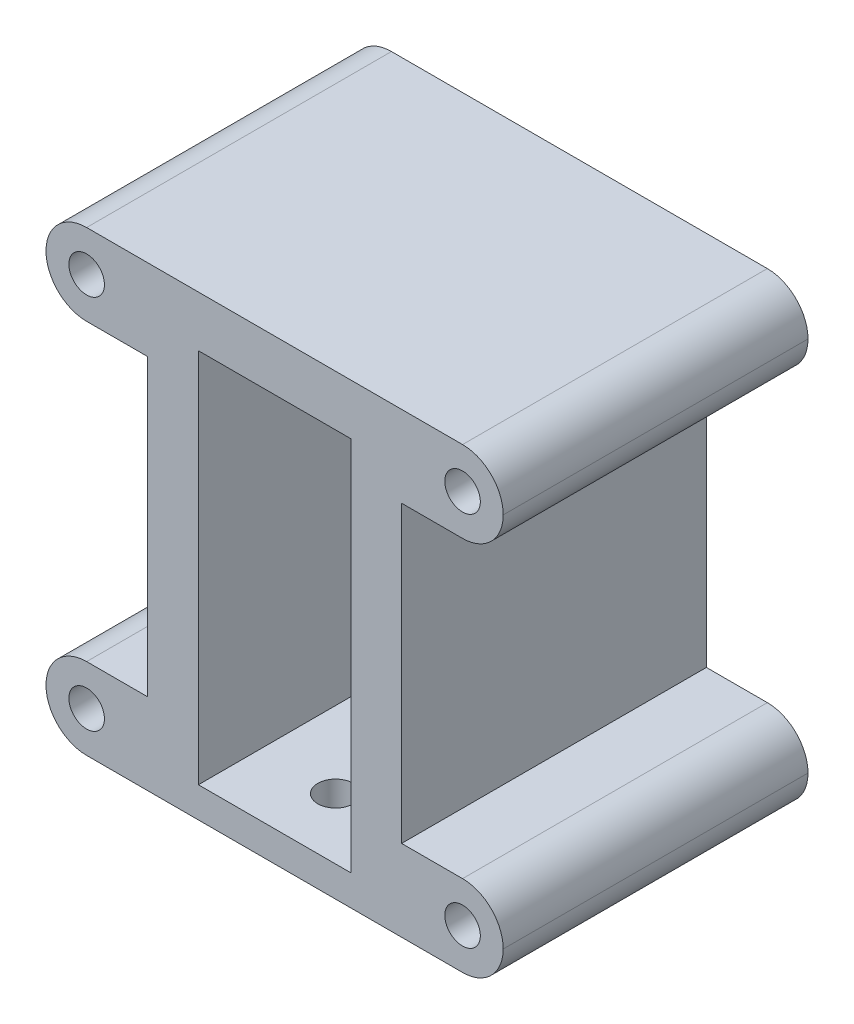
ISO-10303-21;
HEADER;
FILE_DESCRIPTION(('STEP AP214'),'2;1');
FILE_NAME('part.step','',(''),(''),'','','');
FILE_SCHEMA(('AUTOMOTIVE_DESIGN { 1 0 10303 214 1 1 1 1 }'));
ENDSEC;
DATA;
#1=APPLICATION_CONTEXT('core data for automotive mechanical design processes');
#2=APPLICATION_PROTOCOL_DEFINITION('international standard','automotive_design',2000,#1);
#3=PRODUCT_CONTEXT('',#1,'mechanical');
#4=PRODUCT('Part','Part','',(#3));
#5=PRODUCT_RELATED_PRODUCT_CATEGORY('part','',(#4));
#6=PRODUCT_DEFINITION_FORMATION('','',#4);
#7=PRODUCT_DEFINITION_CONTEXT('part definition',#1,'design');
#8=PRODUCT_DEFINITION('design','',#6,#7);
#9=PRODUCT_DEFINITION_SHAPE('','',#8);
#10=(LENGTH_UNIT() NAMED_UNIT(*) SI_UNIT(.MILLI.,.METRE.));
#11=(NAMED_UNIT(*) PLANE_ANGLE_UNIT() SI_UNIT($,.RADIAN.));
#12=(NAMED_UNIT(*) SI_UNIT($,.STERADIAN.) SOLID_ANGLE_UNIT());
#13=UNCERTAINTY_MEASURE_WITH_UNIT(LENGTH_MEASURE(1.E-05),#10,'distance_accuracy_value','');
#14=(GEOMETRIC_REPRESENTATION_CONTEXT(3) GLOBAL_UNCERTAINTY_ASSIGNED_CONTEXT((#13)) GLOBAL_UNIT_ASSIGNED_CONTEXT((#10,
#11,#12)) REPRESENTATION_CONTEXT('',''));
#15=CARTESIAN_POINT('',(0.,0.,0.));
#16=DIRECTION('',(0.,0.,1.));
#17=DIRECTION('',(1.,0.,0.));
#18=AXIS2_PLACEMENT_3D('',#15,#16,#17);
#19=CARTESIAN_POINT('',(-17.0156546986573,-27.,30.));
#20=DIRECTION('',(1.,0.,0.));
#21=DIRECTION('',(0.,1.,0.));
#22=AXIS2_PLACEMENT_3D('',#19,#20,#21);
#23=PLANE('',#22);
#24=DIRECTION('',(0.,0.,-1.));
#25=VECTOR('',#24,1.);
#26=CARTESIAN_POINT('',(-17.0156546986573,-19.,0.));
#27=LINE('',#26,#25);
#28=CARTESIAN_POINT('',(-17.0156546986573,-19.,30.));
#29=VERTEX_POINT('',#28);
#30=CARTESIAN_POINT('',(-17.0156546986573,-19.,0.));
#31=VERTEX_POINT('',#30);
#32=EDGE_CURVE('E226',#29,#31,#27,.T.);
#33=ORIENTED_EDGE('',*,*,#32,.F.);
#34=DIRECTION('',(0.,-1.,0.));
#35=VECTOR('',#34,1.);
#36=CARTESIAN_POINT('',(-17.0156546986573,-27.,30.));
#37=LINE('',#36,#35);
#38=CARTESIAN_POINT('',(-17.0156546986573,10.,30.));
#39=VERTEX_POINT('',#38);
#40=EDGE_CURVE('E271',#39,#29,#37,.T.);
#41=ORIENTED_EDGE('',*,*,#40,.F.);
#42=DIRECTION('',(0.,0.,1.));
#43=VECTOR('',#42,1.);
#44=CARTESIAN_POINT('',(-17.0156546986573,10.,0.));
#45=LINE('',#44,#43);
#46=CARTESIAN_POINT('',(-17.0156546986573,9.99999999999999,0.));
#47=VERTEX_POINT('',#46);
#48=EDGE_CURVE('E229',#47,#39,#45,.T.);
#49=ORIENTED_EDGE('',*,*,#48,.F.);
#50=DIRECTION('',(0.,-1.,0.));
#51=VECTOR('',#50,1.);
#52=CARTESIAN_POINT('',(-17.0156546986573,-27.,0.));
#53=LINE('',#52,#51);
#54=EDGE_CURVE('E279',#47,#31,#53,.T.);
#55=ORIENTED_EDGE('',*,*,#54,.T.);
#56=EDGE_LOOP('',(#33,#41,#49,#55));
#57=FACE_BOUND('',#56,.T.);
#58=ADVANCED_FACE('F36',(#57),#23,.F.);
#59=CARTESIAN_POINT('',(0.,0.,30.));
#60=DIRECTION('',(0.,0.,-1.));
#61=DIRECTION('',(-1.,0.,0.));
#62=AXIS2_PLACEMENT_3D('',#59,#60,#61);
#63=PLANE('',#62);
#64=CARTESIAN_POINT('',(13.9843453013427,14.,30.));
#65=DIRECTION('',(0.,0.,-1.));
#66=DIRECTION('',(-1.,0.,0.));
#67=AXIS2_PLACEMENT_3D('',#64,#65,#66);
#68=CIRCLE('',#67,1.75);
#69=CARTESIAN_POINT('',(12.2343453013427,14.,30.));
#70=VERTEX_POINT('',#69);
#71=EDGE_CURVE('E370',#70,#70,#68,.F.);
#72=ORIENTED_EDGE('',*,*,#71,.F.);
#73=EDGE_LOOP('',(#72));
#74=FACE_BOUND('',#73,.T.);
#75=CARTESIAN_POINT('',(13.9843453013427,-23.,30.));
#76=DIRECTION('',(0.,0.,-1.));
#77=DIRECTION('',(-1.,0.,0.));
#78=AXIS2_PLACEMENT_3D('',#75,#76,#77);
#79=CIRCLE('',#78,1.75);
#80=CARTESIAN_POINT('',(12.2343453013427,-23.,30.));
#81=VERTEX_POINT('',#80);
#82=EDGE_CURVE('E366',#81,#81,#79,.F.);
#83=ORIENTED_EDGE('',*,*,#82,.F.);
#84=EDGE_LOOP('',(#83));
#85=FACE_BOUND('',#84,.T.);
#86=CARTESIAN_POINT('',(-23.0156546986573,14.,30.));
#87=DIRECTION('',(0.,0.,-1.));
#88=DIRECTION('',(-1.,0.,0.));
#89=AXIS2_PLACEMENT_3D('',#86,#87,#88);
#90=CIRCLE('',#89,1.75);
#91=CARTESIAN_POINT('',(-24.7656546986573,14.,30.));
#92=VERTEX_POINT('',#91);
#93=EDGE_CURVE('E219',#92,#92,#90,.T.);
#94=ORIENTED_EDGE('',*,*,#93,.T.);
#95=EDGE_LOOP('',(#94));
#96=FACE_BOUND('',#95,.T.);
#97=CARTESIAN_POINT('',(-23.0156546986573,-23.,30.));
#98=DIRECTION('',(0.,0.,-1.));
#99=DIRECTION('',(-1.,0.,0.));
#100=AXIS2_PLACEMENT_3D('',#97,#98,#99);
#101=CIRCLE('',#100,1.75);
#102=CARTESIAN_POINT('',(-24.7656546986573,-23.,30.));
#103=VERTEX_POINT('',#102);
#104=EDGE_CURVE('E212',#103,#103,#101,.T.);
#105=ORIENTED_EDGE('',*,*,#104,.T.);
#106=EDGE_LOOP('',(#105));
#107=FACE_BOUND('',#106,.T.);
#108=DIRECTION('',(1.,0.,0.));
#109=VECTOR('',#108,1.);
#110=CARTESIAN_POINT('',(-17.0156546986573,-27.,30.));
#111=LINE('',#110,#109);
#112=CARTESIAN_POINT('',(-23.0156546986573,-27.,30.));
#113=VERTEX_POINT('',#112);
#114=CARTESIAN_POINT('',(13.9843453013427,-27.,30.));
#115=VERTEX_POINT('',#114);
#116=EDGE_CURVE('E274',#113,#115,#111,.T.);
#117=ORIENTED_EDGE('',*,*,#116,.T.);
#118=CARTESIAN_POINT('',(13.9843453013427,-23.,30.));
#119=DIRECTION('',(0.,0.,-1.));
#120=DIRECTION('',(-1.,0.,0.));
#121=AXIS2_PLACEMENT_3D('',#118,#119,#120);
#122=CIRCLE('',#121,4.);
#123=CARTESIAN_POINT('',(17.9843453013427,-23.,30.));
#124=VERTEX_POINT('',#123);
#125=EDGE_CURVE('E324',#115,#124,#122,.F.);
#126=ORIENTED_EDGE('',*,*,#125,.T.);
#127=CARTESIAN_POINT('',(13.9843453013427,-23.,30.));
#128=DIRECTION('',(0.,0.,-1.));
#129=DIRECTION('',(-1.,0.,0.));
#130=AXIS2_PLACEMENT_3D('',#127,#128,#129);
#131=CIRCLE('',#130,4.);
#132=CARTESIAN_POINT('',(13.9843453013427,-19.,30.));
#133=VERTEX_POINT('',#132);
#134=EDGE_CURVE('E322',#124,#133,#131,.F.);
#135=ORIENTED_EDGE('',*,*,#134,.T.);
#136=DIRECTION('',(-1.,0.,0.));
#137=VECTOR('',#136,1.);
#138=CARTESIAN_POINT('',(17.9843453013427,-19.,30.));
#139=LINE('',#138,#137);
#140=CARTESIAN_POINT('',(7.98434530134273,-19.,30.));
#141=VERTEX_POINT('',#140);
#142=EDGE_CURVE('E203',#133,#141,#139,.T.);
#143=ORIENTED_EDGE('',*,*,#142,.T.);
#144=DIRECTION('',(0.,1.,0.));
#145=VECTOR('',#144,1.);
#146=CARTESIAN_POINT('',(7.98434530134273,-27.,30.));
#147=LINE('',#146,#145);
#148=CARTESIAN_POINT('',(7.98434530134273,9.99999999999999,30.));
#149=VERTEX_POINT('',#148);
#150=EDGE_CURVE('E266',#141,#149,#147,.T.);
#151=ORIENTED_EDGE('',*,*,#150,.T.);
#152=DIRECTION('',(-1.,0.,0.));
#153=VECTOR('',#152,1.);
#154=CARTESIAN_POINT('',(17.9843453013427,10.,30.));
#155=LINE('',#154,#153);
#156=CARTESIAN_POINT('',(13.9843453013427,10.,30.));
#157=VERTEX_POINT('',#156);
#158=EDGE_CURVE('E185',#157,#149,#155,.T.);
#159=ORIENTED_EDGE('',*,*,#158,.F.);
#160=CARTESIAN_POINT('',(13.9843453013427,14.,30.));
#161=DIRECTION('',(0.,0.,-1.));
#162=DIRECTION('',(-1.,0.,0.));
#163=AXIS2_PLACEMENT_3D('',#160,#161,#162);
#164=CIRCLE('',#163,4.);
#165=CARTESIAN_POINT('',(17.9843453013427,14.,30.));
#166=VERTEX_POINT('',#165);
#167=EDGE_CURVE('E320',#157,#166,#164,.F.);
#168=ORIENTED_EDGE('',*,*,#167,.T.);
#169=CARTESIAN_POINT('',(13.9843453013427,14.,30.));
#170=DIRECTION('',(0.,0.,-1.));
#171=DIRECTION('',(-1.,0.,0.));
#172=AXIS2_PLACEMENT_3D('',#169,#170,#171);
#173=CIRCLE('',#172,4.);
#174=CARTESIAN_POINT('',(13.9843453013427,18.,30.));
#175=VERTEX_POINT('',#174);
#176=EDGE_CURVE('E318',#166,#175,#173,.F.);
#177=ORIENTED_EDGE('',*,*,#176,.T.);
#178=DIRECTION('',(-1.,0.,0.));
#179=VECTOR('',#178,1.);
#180=CARTESIAN_POINT('',(-17.0156546986573,18.,30.));
#181=LINE('',#180,#179);
#182=CARTESIAN_POINT('',(-23.0156546986573,18.,30.));
#183=VERTEX_POINT('',#182);
#184=EDGE_CURVE('E268',#175,#183,#181,.T.);
#185=ORIENTED_EDGE('',*,*,#184,.T.);
#186=CARTESIAN_POINT('',(-23.0156546986573,14.,30.));
#187=DIRECTION('',(0.,0.,-1.));
#188=DIRECTION('',(-1.,0.,0.));
#189=AXIS2_PLACEMENT_3D('',#186,#187,#188);
#190=CIRCLE('',#189,4.);
#191=CARTESIAN_POINT('',(-27.0156546986573,14.,30.));
#192=VERTEX_POINT('',#191);
#193=EDGE_CURVE('E276',#183,#192,#190,.F.);
#194=ORIENTED_EDGE('',*,*,#193,.T.);
#195=CARTESIAN_POINT('',(-23.0156546986573,14.,30.));
#196=DIRECTION('',(0.,0.,-1.));
#197=DIRECTION('',(-1.,0.,0.));
#198=AXIS2_PLACEMENT_3D('',#195,#196,#197);
#199=CIRCLE('',#198,4.);
#200=CARTESIAN_POINT('',(-23.0156546986573,10.,30.));
#201=VERTEX_POINT('',#200);
#202=EDGE_CURVE('E285',#192,#201,#199,.F.);
#203=ORIENTED_EDGE('',*,*,#202,.T.);
#204=DIRECTION('',(1.,0.,0.));
#205=VECTOR('',#204,1.);
#206=CARTESIAN_POINT('',(-27.0156546986573,10.,30.));
#207=LINE('',#206,#205);
#208=EDGE_CURVE('E232',#201,#39,#207,.T.);
#209=ORIENTED_EDGE('',*,*,#208,.T.);
#210=ORIENTED_EDGE('',*,*,#40,.T.);
#211=DIRECTION('',(1.,0.,0.));
#212=VECTOR('',#211,1.);
#213=CARTESIAN_POINT('',(-27.0156546986573,-19.,30.));
#214=LINE('',#213,#212);
#215=CARTESIAN_POINT('',(-23.0156546986573,-19.,30.));
#216=VERTEX_POINT('',#215);
#217=EDGE_CURVE('E222',#216,#29,#214,.T.);
#218=ORIENTED_EDGE('',*,*,#217,.F.);
#219=CARTESIAN_POINT('',(-23.0156546986573,-23.,30.));
#220=DIRECTION('',(0.,0.,-1.));
#221=DIRECTION('',(-1.,0.,0.));
#222=AXIS2_PLACEMENT_3D('',#219,#220,#221);
#223=CIRCLE('',#222,4.);
#224=CARTESIAN_POINT('',(-27.0156546986573,-23.,30.));
#225=VERTEX_POINT('',#224);
#226=EDGE_CURVE('E287',#216,#225,#223,.F.);
#227=ORIENTED_EDGE('',*,*,#226,.T.);
#228=CARTESIAN_POINT('',(-23.0156546986573,-23.,30.));
#229=DIRECTION('',(0.,0.,-1.));
#230=DIRECTION('',(-1.,0.,0.));
#231=AXIS2_PLACEMENT_3D('',#228,#229,#230);
#232=CIRCLE('',#231,4.);
#233=EDGE_CURVE('E289',#225,#113,#232,.F.);
#234=ORIENTED_EDGE('',*,*,#233,.T.);
#235=EDGE_LOOP('',(#117,#126,#135,#143,#151,#159,#168,#177,#185,#194,#203,#209,#210,#218,#227,#234));
#236=FACE_BOUND('',#235,.T.);
#237=DIRECTION('',(0.,1.,0.));
#238=VECTOR('',#237,1.);
#239=CARTESIAN_POINT('',(2.98434530134273,-24.,30.));
#240=LINE('',#239,#238);
#241=CARTESIAN_POINT('',(2.98434530134273,-24.,30.));
#242=VERTEX_POINT('',#241);
#243=CARTESIAN_POINT('',(2.98434530134273,13.,30.));
#244=VERTEX_POINT('',#243);
#245=EDGE_CURVE('E237',#242,#244,#240,.T.);
#246=ORIENTED_EDGE('',*,*,#245,.F.);
#247=DIRECTION('',(1.,0.,0.));
#248=VECTOR('',#247,1.);
#249=CARTESIAN_POINT('',(-12.0156546986573,-24.,30.));
#250=LINE('',#249,#248);
#251=CARTESIAN_POINT('',(-12.0156546986573,-24.,30.));
#252=VERTEX_POINT('',#251);
#253=EDGE_CURVE('E245',#252,#242,#250,.T.);
#254=ORIENTED_EDGE('',*,*,#253,.F.);
#255=DIRECTION('',(0.,-1.,0.));
#256=VECTOR('',#255,1.);
#257=CARTESIAN_POINT('',(-12.0156546986573,-24.,30.));
#258=LINE('',#257,#256);
#259=CARTESIAN_POINT('',(-12.0156546986573,13.,30.));
#260=VERTEX_POINT('',#259);
#261=EDGE_CURVE('E242',#260,#252,#258,.T.);
#262=ORIENTED_EDGE('',*,*,#261,.F.);
#263=DIRECTION('',(-1.,0.,0.));
#264=VECTOR('',#263,1.);
#265=CARTESIAN_POINT('',(-12.0156546986573,13.,30.));
#266=LINE('',#265,#264);
#267=EDGE_CURVE('E239',#244,#260,#266,.T.);
#268=ORIENTED_EDGE('',*,*,#267,.F.);
#269=EDGE_LOOP('',(#246,#254,#262,#268));
#270=FACE_BOUND('',#269,.T.);
#271=ADVANCED_FACE('F374',(#74,#85,#96,#107,#236,#270),#63,.F.);
#272=CARTESIAN_POINT('',(0.,0.,0.));
#273=DIRECTION('',(0.,0.,-1.));
#274=DIRECTION('',(-1.,0.,0.));
#275=AXIS2_PLACEMENT_3D('',#272,#273,#274);
#276=PLANE('',#275);
#277=CARTESIAN_POINT('',(13.9843453013427,14.,0.));
#278=DIRECTION('',(0.,0.,-1.));
#279=DIRECTION('',(-1.,0.,0.));
#280=AXIS2_PLACEMENT_3D('',#277,#278,#279);
#281=CIRCLE('',#280,1.75);
#282=CARTESIAN_POINT('',(12.2343453013427,14.,0.));
#283=VERTEX_POINT('',#282);
#284=EDGE_CURVE('E339',#283,#283,#281,.T.);
#285=ORIENTED_EDGE('',*,*,#284,.F.);
#286=EDGE_LOOP('',(#285));
#287=FACE_BOUND('',#286,.T.);
#288=CARTESIAN_POINT('',(13.9843453013427,-23.,0.));
#289=DIRECTION('',(0.,0.,-1.));
#290=DIRECTION('',(-1.,0.,0.));
#291=AXIS2_PLACEMENT_3D('',#288,#289,#290);
#292=CIRCLE('',#291,1.75);
#293=CARTESIAN_POINT('',(12.2343453013427,-23.,0.));
#294=VERTEX_POINT('',#293);
#295=EDGE_CURVE('E335',#294,#294,#292,.T.);
#296=ORIENTED_EDGE('',*,*,#295,.F.);
#297=EDGE_LOOP('',(#296));
#298=FACE_BOUND('',#297,.T.);
#299=CARTESIAN_POINT('',(-23.0156546986573,14.,0.));
#300=DIRECTION('',(0.,0.,1.));
#301=DIRECTION('',(1.,0.,0.));
#302=AXIS2_PLACEMENT_3D('',#299,#300,#301);
#303=CIRCLE('',#302,1.75);
#304=CARTESIAN_POINT('',(-21.2656546986573,14.,0.));
#305=VERTEX_POINT('',#304);
#306=EDGE_CURVE('E209',#305,#305,#303,.T.);
#307=ORIENTED_EDGE('',*,*,#306,.T.);
#308=EDGE_LOOP('',(#307));
#309=FACE_BOUND('',#308,.T.);
#310=CARTESIAN_POINT('',(-23.0156546986573,-23.,0.));
#311=DIRECTION('',(0.,0.,1.));
#312=DIRECTION('',(1.,0.,0.));
#313=AXIS2_PLACEMENT_3D('',#310,#311,#312);
#314=CIRCLE('',#313,1.75);
#315=CARTESIAN_POINT('',(-21.2656546986573,-23.,0.));
#316=VERTEX_POINT('',#315);
#317=EDGE_CURVE('E213',#316,#316,#314,.T.);
#318=ORIENTED_EDGE('',*,*,#317,.T.);
#319=EDGE_LOOP('',(#318));
#320=FACE_BOUND('',#319,.T.);
#321=CARTESIAN_POINT('',(13.9843453013427,-23.,0.));
#322=DIRECTION('',(0.,0.,-1.));
#323=DIRECTION('',(-1.,0.,0.));
#324=AXIS2_PLACEMENT_3D('',#321,#322,#323);
#325=CIRCLE('',#324,4.);
#326=CARTESIAN_POINT('',(13.9843453013427,-19.,0.));
#327=VERTEX_POINT('',#326);
#328=CARTESIAN_POINT('',(17.9843453013427,-23.,0.));
#329=VERTEX_POINT('',#328);
#330=EDGE_CURVE('E53',#327,#329,#325,.T.);
#331=ORIENTED_EDGE('',*,*,#330,.T.);
#332=CARTESIAN_POINT('',(13.9843453013427,-23.,0.));
#333=DIRECTION('',(0.,0.,-1.));
#334=DIRECTION('',(-1.,0.,0.));
#335=AXIS2_PLACEMENT_3D('',#332,#333,#334);
#336=CIRCLE('',#335,4.);
#337=CARTESIAN_POINT('',(13.9843453013427,-27.,0.));
#338=VERTEX_POINT('',#337);
#339=EDGE_CURVE('E330',#329,#338,#336,.T.);
#340=ORIENTED_EDGE('',*,*,#339,.T.);
#341=DIRECTION('',(1.,0.,0.));
#342=VECTOR('',#341,1.);
#343=CARTESIAN_POINT('',(-17.0156546986573,-27.,0.));
#344=LINE('',#343,#342);
#345=CARTESIAN_POINT('',(-23.0156546986573,-27.,0.));
#346=VERTEX_POINT('',#345);
#347=EDGE_CURVE('E269',#346,#338,#344,.T.);
#348=ORIENTED_EDGE('',*,*,#347,.F.);
#349=CARTESIAN_POINT('',(-23.0156546986573,-23.,0.));
#350=DIRECTION('',(0.,0.,-1.));
#351=DIRECTION('',(-1.,0.,0.));
#352=AXIS2_PLACEMENT_3D('',#349,#350,#351);
#353=CIRCLE('',#352,4.);
#354=CARTESIAN_POINT('',(-27.0156546986573,-23.,0.));
#355=VERTEX_POINT('',#354);
#356=EDGE_CURVE('E301',#346,#355,#353,.T.);
#357=ORIENTED_EDGE('',*,*,#356,.T.);
#358=CARTESIAN_POINT('',(-23.0156546986573,-23.,0.));
#359=DIRECTION('',(0.,0.,-1.));
#360=DIRECTION('',(-1.,0.,0.));
#361=AXIS2_PLACEMENT_3D('',#358,#359,#360);
#362=CIRCLE('',#361,4.);
#363=CARTESIAN_POINT('',(-23.0156546986573,-19.,0.));
#364=VERTEX_POINT('',#363);
#365=EDGE_CURVE('E299',#355,#364,#362,.T.);
#366=ORIENTED_EDGE('',*,*,#365,.T.);
#367=DIRECTION('',(1.,0.,0.));
#368=VECTOR('',#367,1.);
#369=CARTESIAN_POINT('',(-27.0156546986573,-19.,0.));
#370=LINE('',#369,#368);
#371=EDGE_CURVE('E224',#364,#31,#370,.T.);
#372=ORIENTED_EDGE('',*,*,#371,.T.);
#373=ORIENTED_EDGE('',*,*,#54,.F.);
#374=DIRECTION('',(1.,0.,0.));
#375=VECTOR('',#374,1.);
#376=CARTESIAN_POINT('',(-27.0156546986573,10.,0.));
#377=LINE('',#376,#375);
#378=CARTESIAN_POINT('',(-23.0156546986573,10.,0.));
#379=VERTEX_POINT('',#378);
#380=EDGE_CURVE('E234',#379,#47,#377,.T.);
#381=ORIENTED_EDGE('',*,*,#380,.F.);
#382=CARTESIAN_POINT('',(-23.0156546986573,14.,0.));
#383=DIRECTION('',(0.,0.,-1.));
#384=DIRECTION('',(-1.,0.,0.));
#385=AXIS2_PLACEMENT_3D('',#382,#383,#384);
#386=CIRCLE('',#385,4.);
#387=CARTESIAN_POINT('',(-27.0156546986573,14.,0.));
#388=VERTEX_POINT('',#387);
#389=EDGE_CURVE('E297',#379,#388,#386,.T.);
#390=ORIENTED_EDGE('',*,*,#389,.T.);
#391=CARTESIAN_POINT('',(-23.0156546986573,14.,0.));
#392=DIRECTION('',(0.,0.,-1.));
#393=DIRECTION('',(-1.,0.,0.));
#394=AXIS2_PLACEMENT_3D('',#391,#392,#393);
#395=CIRCLE('',#394,4.);
#396=CARTESIAN_POINT('',(-23.0156546986573,18.,0.));
#397=VERTEX_POINT('',#396);
#398=EDGE_CURVE('E294',#388,#397,#395,.T.);
#399=ORIENTED_EDGE('',*,*,#398,.T.);
#400=DIRECTION('',(-1.,0.,0.));
#401=VECTOR('',#400,1.);
#402=CARTESIAN_POINT('',(-17.0156546986573,18.,0.));
#403=LINE('',#402,#401);
#404=CARTESIAN_POINT('',(13.9843453013427,18.,0.));
#405=VERTEX_POINT('',#404);
#406=EDGE_CURVE('E195',#405,#397,#403,.T.);
#407=ORIENTED_EDGE('',*,*,#406,.F.);
#408=CARTESIAN_POINT('',(13.9843453013427,14.,0.));
#409=DIRECTION('',(0.,0.,-1.));
#410=DIRECTION('',(-1.,0.,0.));
#411=AXIS2_PLACEMENT_3D('',#408,#409,#410);
#412=CIRCLE('',#411,4.);
#413=CARTESIAN_POINT('',(17.9843453013427,14.,0.));
#414=VERTEX_POINT('',#413);
#415=EDGE_CURVE('E326',#405,#414,#412,.T.);
#416=ORIENTED_EDGE('',*,*,#415,.T.);
#417=CARTESIAN_POINT('',(13.9843453013427,14.,0.));
#418=DIRECTION('',(0.,0.,-1.));
#419=DIRECTION('',(-1.,0.,0.));
#420=AXIS2_PLACEMENT_3D('',#417,#418,#419);
#421=CIRCLE('',#420,4.);
#422=CARTESIAN_POINT('',(13.9843453013427,10.,0.));
#423=VERTEX_POINT('',#422);
#424=EDGE_CURVE('E180',#414,#423,#421,.T.);
#425=ORIENTED_EDGE('',*,*,#424,.T.);
#426=DIRECTION('',(-1.,0.,0.));
#427=VECTOR('',#426,1.);
#428=CARTESIAN_POINT('',(17.9843453013427,10.,0.));
#429=LINE('',#428,#427);
#430=CARTESIAN_POINT('',(7.98434530134273,10.,0.));
#431=VERTEX_POINT('',#430);
#432=EDGE_CURVE('E174',#423,#431,#429,.T.);
#433=ORIENTED_EDGE('',*,*,#432,.T.);
#434=DIRECTION('',(0.,1.,0.));
#435=VECTOR('',#434,1.);
#436=CARTESIAN_POINT('',(7.98434530134273,-27.,0.));
#437=LINE('',#436,#435);
#438=CARTESIAN_POINT('',(7.98434530134273,-19.,0.));
#439=VERTEX_POINT('',#438);
#440=EDGE_CURVE('E178',#439,#431,#437,.T.);
#441=ORIENTED_EDGE('',*,*,#440,.F.);
#442=DIRECTION('',(-1.,0.,0.));
#443=VECTOR('',#442,1.);
#444=CARTESIAN_POINT('',(17.9843453013427,-19.,0.));
#445=LINE('',#444,#443);
#446=EDGE_CURVE('E201',#327,#439,#445,.T.);
#447=ORIENTED_EDGE('',*,*,#446,.F.);
#448=EDGE_LOOP('',(#331,#340,#348,#357,#366,#372,#373,#381,#390,#399,#407,#416,#425,#433,#441,#447));
#449=FACE_BOUND('',#448,.T.);
#450=DIRECTION('',(1.,0.,0.));
#451=VECTOR('',#450,1.);
#452=CARTESIAN_POINT('',(-12.0156546986573,-24.,0.));
#453=LINE('',#452,#451);
#454=CARTESIAN_POINT('',(-12.0156546986573,-24.,0.));
#455=VERTEX_POINT('',#454);
#456=CARTESIAN_POINT('',(2.98434530134273,-24.,0.));
#457=VERTEX_POINT('',#456);
#458=EDGE_CURVE('E240',#455,#457,#453,.T.);
#459=ORIENTED_EDGE('',*,*,#458,.T.);
#460=DIRECTION('',(0.,1.,0.));
#461=VECTOR('',#460,1.);
#462=CARTESIAN_POINT('',(2.98434530134273,-24.,0.));
#463=LINE('',#462,#461);
#464=CARTESIAN_POINT('',(2.98434530134273,13.,0.));
#465=VERTEX_POINT('',#464);
#466=EDGE_CURVE('E236',#457,#465,#463,.T.);
#467=ORIENTED_EDGE('',*,*,#466,.T.);
#468=DIRECTION('',(-1.,0.,0.));
#469=VECTOR('',#468,1.);
#470=CARTESIAN_POINT('',(-12.0156546986573,13.,0.));
#471=LINE('',#470,#469);
#472=CARTESIAN_POINT('',(-12.0156546986573,13.,0.));
#473=VERTEX_POINT('',#472);
#474=EDGE_CURVE('E250',#465,#473,#471,.T.);
#475=ORIENTED_EDGE('',*,*,#474,.T.);
#476=DIRECTION('',(0.,-1.,0.));
#477=VECTOR('',#476,1.);
#478=CARTESIAN_POINT('',(-12.0156546986573,-24.,0.));
#479=LINE('',#478,#477);
#480=EDGE_CURVE('E253',#473,#455,#479,.T.);
#481=ORIENTED_EDGE('',*,*,#480,.T.);
#482=EDGE_LOOP('',(#459,#467,#475,#481));
#483=FACE_BOUND('',#482,.T.);
#484=ADVANCED_FACE('F176',(#287,#298,#309,#320,#449,#483),#276,.T.);
#485=CARTESIAN_POINT('',(7.98434530134273,-27.,30.));
#486=DIRECTION('',(-1.,0.,0.));
#487=DIRECTION('',(0.,0.,1.));
#488=AXIS2_PLACEMENT_3D('',#485,#486,#487);
#489=PLANE('',#488);
#490=ORIENTED_EDGE('',*,*,#150,.F.);
#491=DIRECTION('',(0.,0.,-1.));
#492=VECTOR('',#491,1.);
#493=CARTESIAN_POINT('',(7.98434530134273,-19.,0.));
#494=LINE('',#493,#492);
#495=EDGE_CURVE('E194',#141,#439,#494,.T.);
#496=ORIENTED_EDGE('',*,*,#495,.T.);
#497=ORIENTED_EDGE('',*,*,#440,.T.);
#498=DIRECTION('',(0.,0.,1.));
#499=VECTOR('',#498,1.);
#500=CARTESIAN_POINT('',(7.98434530134273,10.,0.));
#501=LINE('',#500,#499);
#502=EDGE_CURVE('E186',#431,#149,#501,.T.);
#503=ORIENTED_EDGE('',*,*,#502,.T.);
#504=EDGE_LOOP('',(#490,#496,#497,#503));
#505=FACE_BOUND('',#504,.T.);
#506=ADVANCED_FACE('F192',(#505),#489,.F.);
#507=CARTESIAN_POINT('',(-17.0156546986573,18.,30.));
#508=DIRECTION('',(0.,-1.,0.));
#509=DIRECTION('',(0.,0.,-1.));
#510=AXIS2_PLACEMENT_3D('',#507,#508,#509);
#511=PLANE('',#510);
#512=ORIENTED_EDGE('',*,*,#184,.F.);
#513=DIRECTION('',(0.,0.,-1.));
#514=VECTOR('',#513,1.);
#515=CARTESIAN_POINT('',(13.9843453013427,18.,30.));
#516=LINE('',#515,#514);
#517=EDGE_CURVE('E11',#175,#405,#516,.T.);
#518=ORIENTED_EDGE('',*,*,#517,.T.);
#519=ORIENTED_EDGE('',*,*,#406,.T.);
#520=DIRECTION('',(0.,0.,-1.));
#521=VECTOR('',#520,1.);
#522=CARTESIAN_POINT('',(-23.0156546986573,18.,30.));
#523=LINE('',#522,#521);
#524=EDGE_CURVE('E308',#397,#183,#523,.F.);
#525=ORIENTED_EDGE('',*,*,#524,.T.);
#526=EDGE_LOOP('',(#512,#518,#519,#525));
#527=FACE_BOUND('',#526,.T.);
#528=ADVANCED_FACE('F424',(#527),#511,.F.);
#529=CARTESIAN_POINT('',(-17.0156546986573,-27.,30.));
#530=DIRECTION('',(0.,1.,0.));
#531=DIRECTION('',(0.,0.,1.));
#532=AXIS2_PLACEMENT_3D('',#529,#530,#531);
#533=PLANE('',#532);
#534=CARTESIAN_POINT('',(-4.51565469865727,-27.,24.));
#535=DIRECTION('',(0.,1.,0.));
#536=DIRECTION('',(0.,0.,1.));
#537=AXIS2_PLACEMENT_3D('',#534,#535,#536);
#538=CIRCLE('',#537,1.75);
#539=CARTESIAN_POINT('',(-4.51565469865727,-27.,25.75));
#540=VERTEX_POINT('',#539);
#541=EDGE_CURVE('E342',#540,#540,#538,.T.);
#542=ORIENTED_EDGE('',*,*,#541,.T.);
#543=EDGE_LOOP('',(#542));
#544=FACE_BOUND('',#543,.T.);
#545=CARTESIAN_POINT('',(-4.51565469865727,-27.,6.00000000000001));
#546=DIRECTION('',(0.,1.,0.));
#547=DIRECTION('',(0.,0.,1.));
#548=AXIS2_PLACEMENT_3D('',#545,#546,#547);
#549=CIRCLE('',#548,1.75);
#550=CARTESIAN_POINT('',(-4.51565469865727,-27.,7.75000000000001));
#551=VERTEX_POINT('',#550);
#552=EDGE_CURVE('E356',#551,#551,#549,.T.);
#553=ORIENTED_EDGE('',*,*,#552,.T.);
#554=EDGE_LOOP('',(#553));
#555=FACE_BOUND('',#554,.T.);
#556=CARTESIAN_POINT('',(-4.51565469865727,-27.,15.));
#557=DIRECTION('',(0.,1.,0.));
#558=DIRECTION('',(0.,0.,1.));
#559=AXIS2_PLACEMENT_3D('',#556,#557,#558);
#560=CIRCLE('',#559,1.75);
#561=CARTESIAN_POINT('',(-4.51565469865727,-27.,16.75));
#562=VERTEX_POINT('',#561);
#563=EDGE_CURVE('E362',#562,#562,#560,.T.);
#564=ORIENTED_EDGE('',*,*,#563,.T.);
#565=EDGE_LOOP('',(#564));
#566=FACE_BOUND('',#565,.T.);
#567=ORIENTED_EDGE('',*,*,#347,.T.);
#568=DIRECTION('',(0.,0.,1.));
#569=VECTOR('',#568,1.);
#570=CARTESIAN_POINT('',(13.9843453013427,-27.,30.));
#571=LINE('',#570,#569);
#572=EDGE_CURVE('E311',#338,#115,#571,.T.);
#573=ORIENTED_EDGE('',*,*,#572,.T.);
#574=ORIENTED_EDGE('',*,*,#116,.F.);
#575=DIRECTION('',(0.,0.,1.));
#576=VECTOR('',#575,1.);
#577=CARTESIAN_POINT('',(-23.0156546986573,-27.,30.));
#578=LINE('',#577,#576);
#579=EDGE_CURVE('E291',#113,#346,#578,.F.);
#580=ORIENTED_EDGE('',*,*,#579,.T.);
#581=EDGE_LOOP('',(#567,#573,#574,#580));
#582=FACE_BOUND('',#581,.T.);
#583=ADVANCED_FACE('F384',(#544,#555,#566,#582),#533,.F.);
#584=CARTESIAN_POINT('',(2.98434530134273,-24.,30.));
#585=DIRECTION('',(-1.,0.,0.));
#586=DIRECTION('',(0.,0.,1.));
#587=AXIS2_PLACEMENT_3D('',#584,#585,#586);
#588=PLANE('',#587);
#589=ORIENTED_EDGE('',*,*,#466,.F.);
#590=DIRECTION('',(0.,0.,-1.));
#591=VECTOR('',#590,1.);
#592=CARTESIAN_POINT('',(2.98434530134273,-24.,30.));
#593=LINE('',#592,#591);
#594=EDGE_CURVE('E247',#242,#457,#593,.T.);
#595=ORIENTED_EDGE('',*,*,#594,.F.);
#596=ORIENTED_EDGE('',*,*,#245,.T.);
#597=DIRECTION('',(0.,0.,-1.));
#598=VECTOR('',#597,1.);
#599=CARTESIAN_POINT('',(2.98434530134273,13.,30.));
#600=LINE('',#599,#598);
#601=EDGE_CURVE('E196',#244,#465,#600,.T.);
#602=ORIENTED_EDGE('',*,*,#601,.T.);
#603=EDGE_LOOP('',(#589,#595,#596,#602));
#604=FACE_BOUND('',#603,.T.);
#605=ADVANCED_FACE('F504',(#604),#588,.T.);
#606=CARTESIAN_POINT('',(-12.0156546986573,13.,30.));
#607=DIRECTION('',(0.,-1.,0.));
#608=DIRECTION('',(0.,0.,-1.));
#609=AXIS2_PLACEMENT_3D('',#606,#607,#608);
#610=PLANE('',#609);
#611=ORIENTED_EDGE('',*,*,#474,.F.);
#612=ORIENTED_EDGE('',*,*,#601,.F.);
#613=ORIENTED_EDGE('',*,*,#267,.T.);
#614=DIRECTION('',(0.,0.,-1.));
#615=VECTOR('',#614,1.);
#616=CARTESIAN_POINT('',(-12.0156546986573,13.,30.));
#617=LINE('',#616,#615);
#618=EDGE_CURVE('E262',#260,#473,#617,.T.);
#619=ORIENTED_EDGE('',*,*,#618,.T.);
#620=EDGE_LOOP('',(#611,#612,#613,#619));
#621=FACE_BOUND('',#620,.T.);
#622=ADVANCED_FACE('F500',(#621),#610,.T.);
#623=CARTESIAN_POINT('',(-12.0156546986573,-24.,30.));
#624=DIRECTION('',(1.,0.,0.));
#625=DIRECTION('',(0.,0.,-1.));
#626=AXIS2_PLACEMENT_3D('',#623,#624,#625);
#627=PLANE('',#626);
#628=ORIENTED_EDGE('',*,*,#480,.F.);
#629=ORIENTED_EDGE('',*,*,#618,.F.);
#630=ORIENTED_EDGE('',*,*,#261,.T.);
#631=DIRECTION('',(0.,0.,-1.));
#632=VECTOR('',#631,1.);
#633=CARTESIAN_POINT('',(-12.0156546986573,-24.,30.));
#634=LINE('',#633,#632);
#635=EDGE_CURVE('E260',#252,#455,#634,.T.);
#636=ORIENTED_EDGE('',*,*,#635,.T.);
#637=EDGE_LOOP('',(#628,#629,#630,#636));
#638=FACE_BOUND('',#637,.T.);
#639=ADVANCED_FACE('F496',(#638),#627,.T.);
#640=CARTESIAN_POINT('',(-12.0156546986573,-24.,30.));
#641=DIRECTION('',(0.,1.,0.));
#642=DIRECTION('',(0.,0.,1.));
#643=AXIS2_PLACEMENT_3D('',#640,#641,#642);
#644=PLANE('',#643);
#645=CARTESIAN_POINT('',(-4.51565469865727,-24.,24.));
#646=DIRECTION('',(0.,1.,0.));
#647=DIRECTION('',(0.,0.,1.));
#648=AXIS2_PLACEMENT_3D('',#645,#646,#647);
#649=CIRCLE('',#648,1.75);
#650=CARTESIAN_POINT('',(-4.51565469865727,-24.,25.75));
#651=VERTEX_POINT('',#650);
#652=EDGE_CURVE('E346',#651,#651,#649,.T.);
#653=ORIENTED_EDGE('',*,*,#652,.F.);
#654=EDGE_LOOP('',(#653));
#655=FACE_BOUND('',#654,.T.);
#656=CARTESIAN_POINT('',(-4.51565469865727,-24.,6.00000000000001));
#657=DIRECTION('',(0.,1.,0.));
#658=DIRECTION('',(0.,0.,1.));
#659=AXIS2_PLACEMENT_3D('',#656,#657,#658);
#660=CIRCLE('',#659,1.75);
#661=CARTESIAN_POINT('',(-4.51565469865727,-24.,7.75000000000001));
#662=VERTEX_POINT('',#661);
#663=EDGE_CURVE('E351',#662,#662,#660,.T.);
#664=ORIENTED_EDGE('',*,*,#663,.F.);
#665=EDGE_LOOP('',(#664));
#666=FACE_BOUND('',#665,.T.);
#667=CARTESIAN_POINT('',(-4.51565469865727,-24.,15.));
#668=DIRECTION('',(0.,1.,0.));
#669=DIRECTION('',(0.,0.,1.));
#670=AXIS2_PLACEMENT_3D('',#667,#668,#669);
#671=CIRCLE('',#670,1.75);
#672=CARTESIAN_POINT('',(-4.51565469865727,-24.,16.75));
#673=VERTEX_POINT('',#672);
#674=EDGE_CURVE('E359',#673,#673,#671,.T.);
#675=ORIENTED_EDGE('',*,*,#674,.F.);
#676=EDGE_LOOP('',(#675));
#677=FACE_BOUND('',#676,.T.);
#678=ORIENTED_EDGE('',*,*,#458,.F.);
#679=ORIENTED_EDGE('',*,*,#635,.F.);
#680=ORIENTED_EDGE('',*,*,#253,.T.);
#681=ORIENTED_EDGE('',*,*,#594,.T.);
#682=EDGE_LOOP('',(#678,#679,#680,#681));
#683=FACE_BOUND('',#682,.T.);
#684=ADVANCED_FACE('F493',(#655,#666,#677,#683),#644,.T.);
#685=CARTESIAN_POINT('',(-27.0156546986573,10.,0.));
#686=DIRECTION('',(0.,1.,0.));
#687=DIRECTION('',(0.,0.,1.));
#688=AXIS2_PLACEMENT_3D('',#685,#686,#687);
#689=PLANE('',#688);
#690=ORIENTED_EDGE('',*,*,#208,.F.);
#691=DIRECTION('',(0.,0.,1.));
#692=VECTOR('',#691,1.);
#693=CARTESIAN_POINT('',(-23.0156546986573,10.,0.));
#694=LINE('',#693,#692);
#695=EDGE_CURVE('E305',#201,#379,#694,.F.);
#696=ORIENTED_EDGE('',*,*,#695,.T.);
#697=ORIENTED_EDGE('',*,*,#380,.T.);
#698=ORIENTED_EDGE('',*,*,#48,.T.);
#699=EDGE_LOOP('',(#690,#696,#697,#698));
#700=FACE_BOUND('',#699,.T.);
#701=ADVANCED_FACE('F407',(#700),#689,.F.);
#702=CARTESIAN_POINT('',(-27.0156546986573,-19.,0.));
#703=DIRECTION('',(0.,-1.,0.));
#704=DIRECTION('',(0.,0.,-1.));
#705=AXIS2_PLACEMENT_3D('',#702,#703,#704);
#706=PLANE('',#705);
#707=ORIENTED_EDGE('',*,*,#371,.F.);
#708=DIRECTION('',(0.,0.,-1.));
#709=VECTOR('',#708,1.);
#710=CARTESIAN_POINT('',(-23.0156546986573,-19.,0.));
#711=LINE('',#710,#709);
#712=EDGE_CURVE('E303',#364,#216,#711,.F.);
#713=ORIENTED_EDGE('',*,*,#712,.T.);
#714=ORIENTED_EDGE('',*,*,#217,.T.);
#715=ORIENTED_EDGE('',*,*,#32,.T.);
#716=EDGE_LOOP('',(#707,#713,#714,#715));
#717=FACE_BOUND('',#716,.T.);
#718=ADVANCED_FACE('F399',(#717),#706,.F.);
#719=CARTESIAN_POINT('',(-23.0156546986573,-23.,0.));
#720=DIRECTION('',(0.,0.,1.));
#721=DIRECTION('',(1.,0.,0.));
#722=AXIS2_PLACEMENT_3D('',#719,#720,#721);
#723=CYLINDRICAL_SURFACE('',#722,1.75);
#724=ORIENTED_EDGE('',*,*,#317,.F.);
#725=EDGE_LOOP('',(#724));
#726=FACE_BOUND('',#725,.T.);
#727=ORIENTED_EDGE('',*,*,#104,.F.);
#728=EDGE_LOOP('',(#727));
#729=FACE_BOUND('',#728,.T.);
#730=ADVANCED_FACE('F484',(#726,#729),#723,.F.);
#731=CARTESIAN_POINT('',(-23.0156546986573,14.,0.));
#732=DIRECTION('',(0.,0.,1.));
#733=DIRECTION('',(1.,0.,0.));
#734=AXIS2_PLACEMENT_3D('',#731,#732,#733);
#735=CYLINDRICAL_SURFACE('',#734,1.75);
#736=ORIENTED_EDGE('',*,*,#306,.F.);
#737=EDGE_LOOP('',(#736));
#738=FACE_BOUND('',#737,.T.);
#739=ORIENTED_EDGE('',*,*,#93,.F.);
#740=EDGE_LOOP('',(#739));
#741=FACE_BOUND('',#740,.T.);
#742=ADVANCED_FACE('F456',(#738,#741),#735,.F.);
#743=CARTESIAN_POINT('',(-23.0156546986573,-23.,0.));
#744=DIRECTION('',(0.,0.,-1.));
#745=DIRECTION('',(-1.,0.,0.));
#746=AXIS2_PLACEMENT_3D('',#743,#744,#745);
#747=CYLINDRICAL_SURFACE('',#746,4.);
#748=ORIENTED_EDGE('',*,*,#712,.F.);
#749=ORIENTED_EDGE('',*,*,#365,.F.);
#750=DIRECTION('',(0.,0.,-1.));
#751=VECTOR('',#750,1.);
#752=CARTESIAN_POINT('',(-27.0156546986573,-23.,0.));
#753=LINE('',#752,#751);
#754=EDGE_CURVE('E216',#225,#355,#753,.T.);
#755=ORIENTED_EDGE('',*,*,#754,.F.);
#756=ORIENTED_EDGE('',*,*,#226,.F.);
#757=EDGE_LOOP('',(#748,#749,#755,#756));
#758=FACE_BOUND('',#757,.T.);
#759=ADVANCED_FACE('F395',(#758),#747,.T.);
#760=CARTESIAN_POINT('',(-23.0156546986573,-23.,0.));
#761=DIRECTION('',(0.,0.,1.));
#762=DIRECTION('',(1.,0.,0.));
#763=AXIS2_PLACEMENT_3D('',#760,#761,#762);
#764=CYLINDRICAL_SURFACE('',#763,4.);
#765=ORIENTED_EDGE('',*,*,#356,.F.);
#766=ORIENTED_EDGE('',*,*,#579,.F.);
#767=ORIENTED_EDGE('',*,*,#233,.F.);
#768=ORIENTED_EDGE('',*,*,#754,.T.);
#769=EDGE_LOOP('',(#765,#766,#767,#768));
#770=FACE_BOUND('',#769,.T.);
#771=ADVANCED_FACE('F389',(#770),#764,.T.);
#772=CARTESIAN_POINT('',(-23.0156546986573,14.,0.));
#773=DIRECTION('',(0.,0.,-1.));
#774=DIRECTION('',(-1.,0.,0.));
#775=AXIS2_PLACEMENT_3D('',#772,#773,#774);
#776=CYLINDRICAL_SURFACE('',#775,4.);
#777=ORIENTED_EDGE('',*,*,#524,.F.);
#778=ORIENTED_EDGE('',*,*,#398,.F.);
#779=DIRECTION('',(0.,0.,-1.));
#780=VECTOR('',#779,1.);
#781=CARTESIAN_POINT('',(-27.0156546986573,14.,0.));
#782=LINE('',#781,#780);
#783=EDGE_CURVE('E208',#192,#388,#782,.T.);
#784=ORIENTED_EDGE('',*,*,#783,.F.);
#785=ORIENTED_EDGE('',*,*,#193,.F.);
#786=EDGE_LOOP('',(#777,#778,#784,#785));
#787=FACE_BOUND('',#786,.T.);
#788=ADVANCED_FACE('F416',(#787),#776,.T.);
#789=CARTESIAN_POINT('',(-23.0156546986573,14.,0.));
#790=DIRECTION('',(0.,0.,1.));
#791=DIRECTION('',(1.,0.,0.));
#792=AXIS2_PLACEMENT_3D('',#789,#790,#791);
#793=CYLINDRICAL_SURFACE('',#792,4.);
#794=ORIENTED_EDGE('',*,*,#389,.F.);
#795=ORIENTED_EDGE('',*,*,#695,.F.);
#796=ORIENTED_EDGE('',*,*,#202,.F.);
#797=ORIENTED_EDGE('',*,*,#783,.T.);
#798=EDGE_LOOP('',(#794,#795,#796,#797));
#799=FACE_BOUND('',#798,.T.);
#800=ADVANCED_FACE('F419',(#799),#793,.T.);
#801=CARTESIAN_POINT('',(17.9843453013427,10.,0.));
#802=DIRECTION('',(0.,-1.,0.));
#803=DIRECTION('',(1.,0.,0.));
#804=AXIS2_PLACEMENT_3D('',#801,#802,#803);
#805=PLANE('',#804);
#806=ORIENTED_EDGE('',*,*,#432,.F.);
#807=DIRECTION('',(0.,0.,1.));
#808=VECTOR('',#807,1.);
#809=CARTESIAN_POINT('',(13.9843453013427,10.,30.));
#810=LINE('',#809,#808);
#811=EDGE_CURVE('E45',#423,#157,#810,.T.);
#812=ORIENTED_EDGE('',*,*,#811,.T.);
#813=ORIENTED_EDGE('',*,*,#158,.T.);
#814=ORIENTED_EDGE('',*,*,#502,.F.);
#815=EDGE_LOOP('',(#806,#812,#813,#814));
#816=FACE_BOUND('',#815,.T.);
#817=ADVANCED_FACE('F198',(#816),#805,.T.);
#818=CARTESIAN_POINT('',(17.9843453013427,-19.,0.));
#819=DIRECTION('',(0.,1.,0.));
#820=DIRECTION('',(-1.,0.,0.));
#821=AXIS2_PLACEMENT_3D('',#818,#819,#820);
#822=PLANE('',#821);
#823=ORIENTED_EDGE('',*,*,#142,.F.);
#824=DIRECTION('',(0.,0.,-1.));
#825=VECTOR('',#824,1.);
#826=CARTESIAN_POINT('',(13.9843453013427,-19.,0.));
#827=LINE('',#826,#825);
#828=EDGE_CURVE('E61',#133,#327,#827,.T.);
#829=ORIENTED_EDGE('',*,*,#828,.T.);
#830=ORIENTED_EDGE('',*,*,#446,.T.);
#831=ORIENTED_EDGE('',*,*,#495,.F.);
#832=EDGE_LOOP('',(#823,#829,#830,#831));
#833=FACE_BOUND('',#832,.T.);
#834=ADVANCED_FACE('F377',(#833),#822,.T.);
#835=CARTESIAN_POINT('',(13.9843453013427,-23.,0.));
#836=DIRECTION('',(0.,0.,1.));
#837=DIRECTION('',(1.,0.,0.));
#838=AXIS2_PLACEMENT_3D('',#835,#836,#837);
#839=CYLINDRICAL_SURFACE('',#838,1.75);
#840=ORIENTED_EDGE('',*,*,#295,.T.);
#841=EDGE_LOOP('',(#840));
#842=FACE_BOUND('',#841,.T.);
#843=ORIENTED_EDGE('',*,*,#82,.T.);
#844=EDGE_LOOP('',(#843));
#845=FACE_BOUND('',#844,.T.);
#846=ADVANCED_FACE('F467',(#842,#845),#839,.F.);
#847=CARTESIAN_POINT('',(13.9843453013427,14.,0.));
#848=DIRECTION('',(0.,0.,1.));
#849=DIRECTION('',(1.,0.,0.));
#850=AXIS2_PLACEMENT_3D('',#847,#848,#849);
#851=CYLINDRICAL_SURFACE('',#850,1.75);
#852=ORIENTED_EDGE('',*,*,#284,.T.);
#853=EDGE_LOOP('',(#852));
#854=FACE_BOUND('',#853,.T.);
#855=ORIENTED_EDGE('',*,*,#71,.T.);
#856=EDGE_LOOP('',(#855));
#857=FACE_BOUND('',#856,.T.);
#858=ADVANCED_FACE('F463',(#854,#857),#851,.F.);
#859=CARTESIAN_POINT('',(13.9843453013427,-23.,0.));
#860=DIRECTION('',(0.,0.,1.));
#861=DIRECTION('',(1.,0.,0.));
#862=AXIS2_PLACEMENT_3D('',#859,#860,#861);
#863=CYLINDRICAL_SURFACE('',#862,4.);
#864=DIRECTION('',(0.,0.,-1.));
#865=VECTOR('',#864,1.);
#866=CARTESIAN_POINT('',(17.9843453013427,-23.,30.));
#867=LINE('',#866,#865);
#868=EDGE_CURVE('E333',#329,#124,#867,.F.);
#869=ORIENTED_EDGE('',*,*,#868,.F.);
#870=ORIENTED_EDGE('',*,*,#330,.F.);
#871=ORIENTED_EDGE('',*,*,#828,.F.);
#872=ORIENTED_EDGE('',*,*,#134,.F.);
#873=EDGE_LOOP('',(#869,#870,#871,#872));
#874=FACE_BOUND('',#873,.T.);
#875=ADVANCED_FACE('F379',(#874),#863,.T.);
#876=CARTESIAN_POINT('',(13.9843453013427,-23.,30.));
#877=DIRECTION('',(0.,0.,1.));
#878=DIRECTION('',(1.,0.,0.));
#879=AXIS2_PLACEMENT_3D('',#876,#877,#878);
#880=CYLINDRICAL_SURFACE('',#879,4.);
#881=ORIENTED_EDGE('',*,*,#339,.F.);
#882=ORIENTED_EDGE('',*,*,#868,.T.);
#883=ORIENTED_EDGE('',*,*,#125,.F.);
#884=ORIENTED_EDGE('',*,*,#572,.F.);
#885=EDGE_LOOP('',(#881,#882,#883,#884));
#886=FACE_BOUND('',#885,.T.);
#887=ADVANCED_FACE('F381',(#886),#880,.T.);
#888=CARTESIAN_POINT('',(13.9843453013427,14.,30.));
#889=DIRECTION('',(0.,0.,-1.));
#890=DIRECTION('',(-1.,0.,0.));
#891=AXIS2_PLACEMENT_3D('',#888,#889,#890);
#892=CYLINDRICAL_SURFACE('',#891,4.);
#893=DIRECTION('',(0.,0.,-1.));
#894=VECTOR('',#893,1.);
#895=CARTESIAN_POINT('',(17.9843453013427,14.,0.));
#896=LINE('',#895,#894);
#897=EDGE_CURVE('E40',#414,#166,#896,.F.);
#898=ORIENTED_EDGE('',*,*,#897,.F.);
#899=ORIENTED_EDGE('',*,*,#415,.F.);
#900=ORIENTED_EDGE('',*,*,#517,.F.);
#901=ORIENTED_EDGE('',*,*,#176,.F.);
#902=EDGE_LOOP('',(#898,#899,#900,#901));
#903=FACE_BOUND('',#902,.T.);
#904=ADVANCED_FACE('F38',(#903),#892,.T.);
#905=CARTESIAN_POINT('',(13.9843453013427,14.,0.));
#906=DIRECTION('',(0.,0.,-1.));
#907=DIRECTION('',(-1.,0.,0.));
#908=AXIS2_PLACEMENT_3D('',#905,#906,#907);
#909=CYLINDRICAL_SURFACE('',#908,4.);
#910=ORIENTED_EDGE('',*,*,#424,.F.);
#911=ORIENTED_EDGE('',*,*,#897,.T.);
#912=ORIENTED_EDGE('',*,*,#167,.F.);
#913=ORIENTED_EDGE('',*,*,#811,.F.);
#914=EDGE_LOOP('',(#910,#911,#912,#913));
#915=FACE_BOUND('',#914,.T.);
#916=ADVANCED_FACE('F427',(#915),#909,.T.);
#917=CARTESIAN_POINT('',(-4.51565469865727,-27.,15.));
#918=DIRECTION('',(0.,1.,0.));
#919=DIRECTION('',(0.,0.,1.));
#920=AXIS2_PLACEMENT_3D('',#917,#918,#919);
#921=CYLINDRICAL_SURFACE('',#920,1.75);
#922=ORIENTED_EDGE('',*,*,#563,.F.);
#923=EDGE_LOOP('',(#922));
#924=FACE_BOUND('',#923,.T.);
#925=ORIENTED_EDGE('',*,*,#674,.T.);
#926=EDGE_LOOP('',(#925));
#927=FACE_BOUND('',#926,.T.);
#928=ADVANCED_FACE('F429',(#924,#927),#921,.F.);
#929=CARTESIAN_POINT('',(-4.51565469865727,-27.,6.00000000000001));
#930=DIRECTION('',(0.,1.,0.));
#931=DIRECTION('',(0.,0.,1.));
#932=AXIS2_PLACEMENT_3D('',#929,#930,#931);
#933=CYLINDRICAL_SURFACE('',#932,1.75);
#934=ORIENTED_EDGE('',*,*,#552,.F.);
#935=EDGE_LOOP('',(#934));
#936=FACE_BOUND('',#935,.T.);
#937=ORIENTED_EDGE('',*,*,#663,.T.);
#938=EDGE_LOOP('',(#937));
#939=FACE_BOUND('',#938,.T.);
#940=ADVANCED_FACE('F434',(#936,#939),#933,.F.);
#941=CARTESIAN_POINT('',(-4.51565469865727,-27.,24.));
#942=DIRECTION('',(0.,1.,0.));
#943=DIRECTION('',(0.,0.,1.));
#944=AXIS2_PLACEMENT_3D('',#941,#942,#943);
#945=CYLINDRICAL_SURFACE('',#944,1.75);
#946=ORIENTED_EDGE('',*,*,#541,.F.);
#947=EDGE_LOOP('',(#946));
#948=FACE_BOUND('',#947,.T.);
#949=ORIENTED_EDGE('',*,*,#652,.T.);
#950=EDGE_LOOP('',(#949));
#951=FACE_BOUND('',#950,.T.);
#952=ADVANCED_FACE('F652',(#948,#951),#945,.F.);
#953=CLOSED_SHELL('',(#58,#271,#484,#506,#528,#583,#605,#622,#639,#684,#701,#718,#730,#742,#759,
#771,#788,#800,#817,#834,#846,#858,#875,#887,#904,#916,#928,#940,#952));
#954=MANIFOLD_SOLID_BREP('B2',#953);
#955=ADVANCED_BREP_SHAPE_REPRESENTATION('',(#18,#954),#14);
#956=SHAPE_DEFINITION_REPRESENTATION(#9,#955);
ENDSEC;
END-ISO-10303-21;
